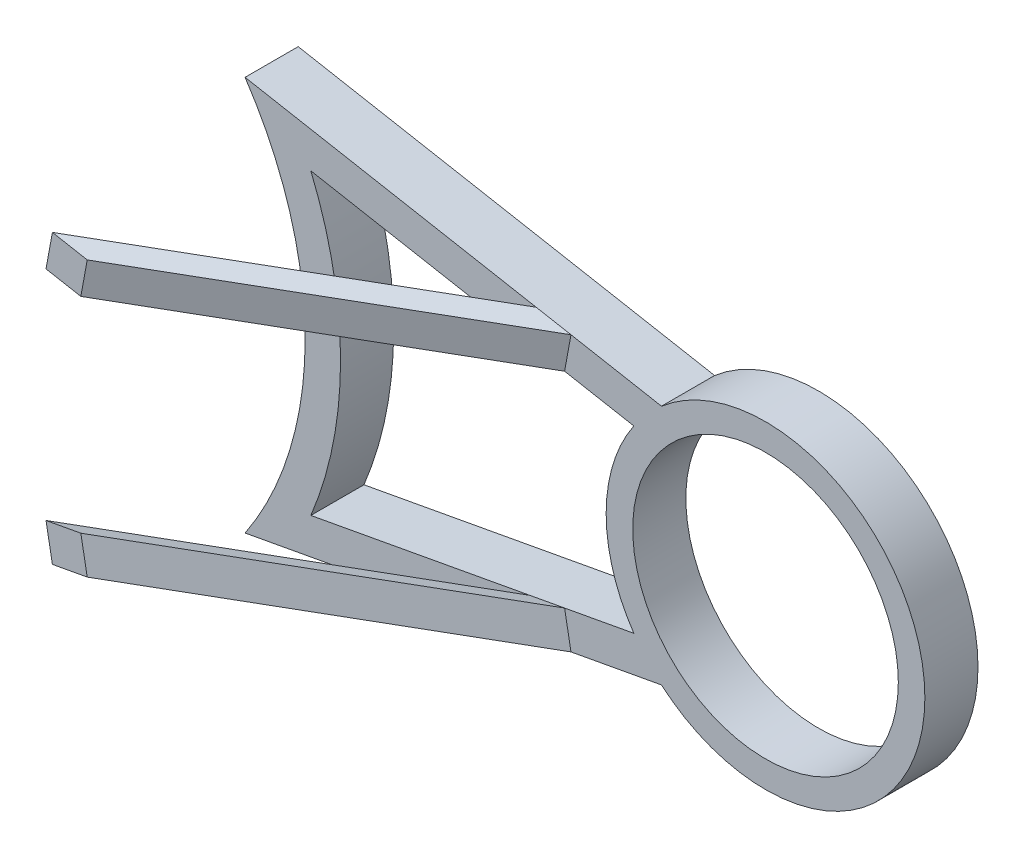
ISO-10303-21;
HEADER;
FILE_DESCRIPTION(('STEP AP214'),'2;1');
FILE_NAME('part.step','',(''),(''),'','','');
FILE_SCHEMA(('AUTOMOTIVE_DESIGN { 1 0 10303 214 1 1 1 1 }'));
ENDSEC;
DATA;
#1=APPLICATION_CONTEXT('core data for automotive mechanical design processes');
#2=APPLICATION_PROTOCOL_DEFINITION('international standard','automotive_design',2000,#1);
#3=PRODUCT_CONTEXT('',#1,'mechanical');
#4=PRODUCT('Part','Part','',(#3));
#5=PRODUCT_RELATED_PRODUCT_CATEGORY('part','',(#4));
#6=PRODUCT_DEFINITION_FORMATION('','',#4);
#7=PRODUCT_DEFINITION_CONTEXT('part definition',#1,'design');
#8=PRODUCT_DEFINITION('design','',#6,#7);
#9=PRODUCT_DEFINITION_SHAPE('','',#8);
#10=(LENGTH_UNIT() NAMED_UNIT(*) SI_UNIT(.MILLI.,.METRE.));
#11=(NAMED_UNIT(*) PLANE_ANGLE_UNIT() SI_UNIT($,.RADIAN.));
#12=(NAMED_UNIT(*) SI_UNIT($,.STERADIAN.) SOLID_ANGLE_UNIT());
#13=UNCERTAINTY_MEASURE_WITH_UNIT(LENGTH_MEASURE(1.E-05),#10,'distance_accuracy_value','');
#14=(GEOMETRIC_REPRESENTATION_CONTEXT(3) GLOBAL_UNCERTAINTY_ASSIGNED_CONTEXT((#13)) GLOBAL_UNIT_ASSIGNED_CONTEXT((#10,
#11,#12)) REPRESENTATION_CONTEXT('',''));
#15=CARTESIAN_POINT('',(0.,0.,0.));
#16=DIRECTION('',(0.,0.,1.));
#17=DIRECTION('',(1.,0.,0.));
#18=AXIS2_PLACEMENT_3D('',#15,#16,#17);
#19=CARTESIAN_POINT('',(4889.77220891143,3641.46133227957,11009.4574157783));
#20=DIRECTION('',(0.,0.,1.));
#21=DIRECTION('',(1.,0.,0.));
#22=AXIS2_PLACEMENT_3D('',#19,#20,#21);
#23=PLANE('',#22);
#24=CARTESIAN_POINT('',(4889.77220891143,3641.46133227957,11009.4574157783));
#25=DIRECTION('',(0.,0.,1.));
#26=DIRECTION('',(1.,0.,0.));
#27=AXIS2_PLACEMENT_3D('',#24,#25,#26);
#28=CIRCLE('',#27,375.);
#29=CARTESIAN_POINT('',(5264.77220891143,3641.46133227957,11009.4574157783));
#30=VERTEX_POINT('',#29);
#31=EDGE_CURVE('E227',#30,#30,#28,.T.);
#32=ORIENTED_EDGE('',*,*,#31,.F.);
#33=EDGE_LOOP('',(#32));
#34=FACE_BOUND('',#33,.T.);
#35=DIRECTION('',(0.983488317783864,0.180971624247187,0.));
#36=VECTOR('',#35,1.);
#37=CARTESIAN_POINT('',(4517.98192605905,3387.94213068618,11009.4574157783));
#38=LINE('',#37,#36);
#39=CARTESIAN_POINT('',(4322.38763499596,3351.95083734074,11009.4574157783));
#40=VERTEX_POINT('',#39);
#41=CARTESIAN_POINT('',(4517.98192605905,3387.94213068618,11009.4574157783));
#42=VERTEX_POINT('',#41);
#43=EDGE_CURVE('E480',#40,#42,#38,.T.);
#44=ORIENTED_EDGE('',*,*,#43,.F.);
#45=DIRECTION('',(-0.180971624247182,0.983488317783865,0.));
#46=VECTOR('',#45,1.);
#47=CARTESIAN_POINT('',(4340.48479742068,3253.60200556236,11009.4574157783));
#48=LINE('',#47,#46);
#49=CARTESIAN_POINT('',(4340.48479742068,3253.60200556236,11009.4574157783));
#50=VERTEX_POINT('',#49);
#51=EDGE_CURVE('E47',#50,#40,#48,.T.);
#52=ORIENTED_EDGE('',*,*,#51,.F.);
#53=DIRECTION('',(0.983488317783864,0.180971624247188,0.));
#54=VECTOR('',#53,1.);
#55=CARTESIAN_POINT('',(4595.96546082499,3300.61298656131,11009.4574157783));
#56=LINE('',#55,#54);
#57=CARTESIAN_POINT('',(4595.96546082499,3300.61298656131,11009.4574157783));
#58=VERTEX_POINT('',#57);
#59=EDGE_CURVE('E271',#50,#58,#56,.T.);
#60=ORIENTED_EDGE('',*,*,#59,.T.);
#61=CARTESIAN_POINT('',(4889.77220891143,3641.46133227957,11009.4574157783));
#62=DIRECTION('',(0.,0.,1.));
#63=DIRECTION('',(1.,0.,0.));
#64=AXIS2_PLACEMENT_3D('',#61,#62,#63);
#65=CIRCLE('',#64,450.);
#66=CARTESIAN_POINT('',(4595.96546082499,3982.30967799782,11009.4574157783));
#67=VERTEX_POINT('',#66);
#68=EDGE_CURVE('E260',#58,#67,#65,.T.);
#69=ORIENTED_EDGE('',*,*,#68,.T.);
#70=DIRECTION('',(-0.983488317783864,0.180971624247188,0.));
#71=VECTOR('',#70,1.);
#72=CARTESIAN_POINT('',(4595.96546082499,3982.30967799782,11009.4574157783));
#73=LINE('',#72,#71);
#74=CARTESIAN_POINT('',(4340.48479742068,4029.32065899677,11009.4574157783));
#75=VERTEX_POINT('',#74);
#76=EDGE_CURVE('E274',#67,#75,#73,.T.);
#77=ORIENTED_EDGE('',*,*,#76,.T.);
#78=DIRECTION('',(0.180971624247184,0.983488317783865,0.));
#79=VECTOR('',#78,1.);
#80=CARTESIAN_POINT('',(4340.48479742068,4029.32065899677,11009.4574157783));
#81=LINE('',#80,#79);
#82=CARTESIAN_POINT('',(4322.38763499596,3930.97182721838,11009.4574157783));
#83=VERTEX_POINT('',#82);
#84=EDGE_CURVE('E167',#83,#75,#81,.T.);
#85=ORIENTED_EDGE('',*,*,#84,.F.);
#86=DIRECTION('',(-0.983488317783864,0.180971624247188,0.));
#87=VECTOR('',#86,1.);
#88=CARTESIAN_POINT('',(4517.98192605905,3894.98053387295,11009.4574157783));
#89=LINE('',#88,#87);
#90=CARTESIAN_POINT('',(4517.98192605905,3894.98053387295,11009.4574157783));
#91=VERTEX_POINT('',#90);
#92=EDGE_CURVE('E246',#91,#83,#89,.T.);
#93=ORIENTED_EDGE('',*,*,#92,.F.);
#94=CARTESIAN_POINT('',(4889.77220891143,3641.46133227957,11009.4574157783));
#95=DIRECTION('',(0.,0.,-1.));
#96=DIRECTION('',(1.,0.,0.));
#97=AXIS2_PLACEMENT_3D('',#94,#95,#96);
#98=CIRCLE('',#97,450.);
#99=EDGE_CURVE('E234',#42,#91,#98,.T.);
#100=ORIENTED_EDGE('',*,*,#99,.F.);
#101=EDGE_LOOP('',(#44,#52,#60,#69,#77,#85,#93,#100));
#102=FACE_BOUND('',#101,.T.);
#103=ADVANCED_FACE('F30',(#34,#102),#23,.T.);
#104=CARTESIAN_POINT('',(3420.14289386198,3084.24994907319,11009.4574157783));
#105=VERTEX_POINT('',#104);
#106=CARTESIAN_POINT('',(4242.1359656423,3235.50484313764,11009.4574157783));
#107=VERTEX_POINT('',#106);
#108=EDGE_CURVE('E257',#105,#107,#56,.T.);
#109=ORIENTED_EDGE('',*,*,#108,.T.);
#110=DIRECTION('',(0.180971624247187,-0.983488317783864,0.));
#111=VECTOR('',#110,1.);
#112=CARTESIAN_POINT('',(4242.1359656423,3235.50484313764,11009.4574157783));
#113=LINE('',#112,#111);
#114=CARTESIAN_POINT('',(4224.03880321758,3333.85367491603,11009.4574157783));
#115=VERTEX_POINT('',#114);
#116=EDGE_CURVE('E477',#115,#107,#113,.T.);
#117=ORIENTED_EDGE('',*,*,#116,.F.);
#118=CARTESIAN_POINT('',(3605.87195783464,3220.10483210639,11009.4574157783));
#119=VERTEX_POINT('',#118);
#120=EDGE_CURVE('E493',#119,#115,#38,.T.);
#121=ORIENTED_EDGE('',*,*,#120,.F.);
#122=CARTESIAN_POINT('',(2589.77220891143,3641.46133227957,11009.4574157783));
#123=DIRECTION('',(0.,0.,-1.));
#124=DIRECTION('',(1.,0.,0.));
#125=AXIS2_PLACEMENT_3D('',#122,#123,#124);
#126=CIRCLE('',#125,1100.);
#127=CARTESIAN_POINT('',(3605.87195783464,4062.81783245274,11009.4574157783));
#128=VERTEX_POINT('',#127);
#129=EDGE_CURVE('E240',#128,#119,#126,.T.);
#130=ORIENTED_EDGE('',*,*,#129,.F.);
#131=CARTESIAN_POINT('',(4224.03880321758,3949.0689896431,11009.4574157783));
#132=VERTEX_POINT('',#131);
#133=EDGE_CURVE('E236',#132,#128,#89,.T.);
#134=ORIENTED_EDGE('',*,*,#133,.F.);
#135=DIRECTION('',(-0.18097162424719,-0.983488317783864,0.));
#136=VECTOR('',#135,1.);
#137=CARTESIAN_POINT('',(4242.1359656423,4047.41782142149,11009.4574157783));
#138=LINE('',#137,#136);
#139=CARTESIAN_POINT('',(4242.1359656423,4047.41782142149,11009.4574157783));
#140=VERTEX_POINT('',#139);
#141=EDGE_CURVE('E55',#140,#132,#138,.T.);
#142=ORIENTED_EDGE('',*,*,#141,.F.);
#143=CARTESIAN_POINT('',(3420.14289386198,4198.67271548594,11009.4574157783));
#144=VERTEX_POINT('',#143);
#145=EDGE_CURVE('E279',#140,#144,#73,.T.);
#146=ORIENTED_EDGE('',*,*,#145,.T.);
#147=CARTESIAN_POINT('',(2589.77220891143,3641.46133227957,11009.4574157783));
#148=DIRECTION('',(0.,0.,-1.));
#149=DIRECTION('',(1.,0.,0.));
#150=AXIS2_PLACEMENT_3D('',#147,#148,#149);
#151=CIRCLE('',#150,1000.);
#152=EDGE_CURVE('E272',#144,#105,#151,.T.);
#153=ORIENTED_EDGE('',*,*,#152,.T.);
#154=EDGE_LOOP('',(#109,#117,#121,#130,#134,#142,#146,#153));
#155=FACE_BOUND('',#154,.T.);
#156=ADVANCED_FACE('F316',(#155),#23,.T.);
#157=CARTESIAN_POINT('',(4889.77220891143,3641.46133227957,10859.4574157783));
#158=DIRECTION('',(0.,0.,1.));
#159=DIRECTION('',(1.,0.,0.));
#160=AXIS2_PLACEMENT_3D('',#157,#158,#159);
#161=PLANE('',#160);
#162=CARTESIAN_POINT('',(4889.77220891143,3641.46133227957,10859.4574157783));
#163=DIRECTION('',(0.,0.,-1.));
#164=DIRECTION('',(1.,0.,0.));
#165=AXIS2_PLACEMENT_3D('',#162,#163,#164);
#166=CIRCLE('',#165,450.);
#167=CARTESIAN_POINT('',(4517.98192605905,3387.94213068618,10859.4574157783));
#168=VERTEX_POINT('',#167);
#169=CARTESIAN_POINT('',(4517.98192605905,3894.98053387295,10859.4574157783));
#170=VERTEX_POINT('',#169);
#171=EDGE_CURVE('E232',#168,#170,#166,.T.);
#172=ORIENTED_EDGE('',*,*,#171,.T.);
#173=DIRECTION('',(-0.983488317783864,0.180971624247188,0.));
#174=VECTOR('',#173,1.);
#175=CARTESIAN_POINT('',(4517.98192605905,3894.98053387295,10859.4574157783));
#176=LINE('',#175,#174);
#177=CARTESIAN_POINT('',(3605.87195783464,4062.81783245274,10859.4574157783));
#178=VERTEX_POINT('',#177);
#179=EDGE_CURVE('E504',#170,#178,#176,.T.);
#180=ORIENTED_EDGE('',*,*,#179,.T.);
#181=CARTESIAN_POINT('',(2589.77220891143,3641.46133227957,10859.4574157783));
#182=DIRECTION('',(0.,0.,-1.));
#183=DIRECTION('',(1.,0.,0.));
#184=AXIS2_PLACEMENT_3D('',#181,#182,#183);
#185=CIRCLE('',#184,1100.);
#186=CARTESIAN_POINT('',(3605.87195783464,3220.10483210639,10859.4574157783));
#187=VERTEX_POINT('',#186);
#188=EDGE_CURVE('E507',#178,#187,#185,.T.);
#189=ORIENTED_EDGE('',*,*,#188,.T.);
#190=DIRECTION('',(0.983488317783864,0.180971624247187,0.));
#191=VECTOR('',#190,1.);
#192=CARTESIAN_POINT('',(4517.98192605905,3387.94213068618,10859.4574157783));
#193=LINE('',#192,#191);
#194=EDGE_CURVE('E237',#187,#168,#193,.T.);
#195=ORIENTED_EDGE('',*,*,#194,.T.);
#196=EDGE_LOOP('',(#172,#180,#189,#195));
#197=FACE_BOUND('',#196,.T.);
#198=CARTESIAN_POINT('',(4889.77220891143,3641.46133227957,10859.4574157783));
#199=DIRECTION('',(0.,0.,1.));
#200=DIRECTION('',(1.,0.,0.));
#201=AXIS2_PLACEMENT_3D('',#198,#199,#200);
#202=CIRCLE('',#201,450.);
#203=CARTESIAN_POINT('',(4595.96546082499,3300.61298656131,10859.4574157783));
#204=VERTEX_POINT('',#203);
#205=CARTESIAN_POINT('',(4595.96546082499,3982.30967799782,10859.4574157783));
#206=VERTEX_POINT('',#205);
#207=EDGE_CURVE('E265',#204,#206,#202,.T.);
#208=ORIENTED_EDGE('',*,*,#207,.F.);
#209=DIRECTION('',(0.983488317783864,0.180971624247188,0.));
#210=VECTOR('',#209,1.);
#211=CARTESIAN_POINT('',(4595.96546082499,3300.61298656131,10859.4574157783));
#212=LINE('',#211,#210);
#213=CARTESIAN_POINT('',(3420.14289386198,3084.24994907319,10859.4574157783));
#214=VERTEX_POINT('',#213);
#215=EDGE_CURVE('E258',#214,#204,#212,.T.);
#216=ORIENTED_EDGE('',*,*,#215,.F.);
#217=CARTESIAN_POINT('',(2589.77220891143,3641.46133227957,10859.4574157783));
#218=DIRECTION('',(0.,0.,-1.));
#219=DIRECTION('',(1.,0.,0.));
#220=AXIS2_PLACEMENT_3D('',#217,#218,#219);
#221=CIRCLE('',#220,1000.);
#222=CARTESIAN_POINT('',(3420.14289386198,4198.67271548594,10859.4574157783));
#223=VERTEX_POINT('',#222);
#224=EDGE_CURVE('E261',#223,#214,#221,.T.);
#225=ORIENTED_EDGE('',*,*,#224,.F.);
#226=DIRECTION('',(-0.983488317783864,0.180971624247188,0.));
#227=VECTOR('',#226,1.);
#228=CARTESIAN_POINT('',(4595.96546082499,3982.30967799782,10859.4574157783));
#229=LINE('',#228,#227);
#230=EDGE_CURVE('E263',#206,#223,#229,.T.);
#231=ORIENTED_EDGE('',*,*,#230,.F.);
#232=EDGE_LOOP('',(#208,#216,#225,#231));
#233=FACE_BOUND('',#232,.T.);
#234=CARTESIAN_POINT('',(4889.77220891143,3641.46133227957,10859.4574157783));
#235=DIRECTION('',(0.,0.,1.));
#236=DIRECTION('',(1.,0.,0.));
#237=AXIS2_PLACEMENT_3D('',#234,#235,#236);
#238=CIRCLE('',#237,375.);
#239=CARTESIAN_POINT('',(5264.77220891143,3641.46133227957,10859.4574157783));
#240=VERTEX_POINT('',#239);
#241=EDGE_CURVE('E223',#240,#240,#238,.T.);
#242=ORIENTED_EDGE('',*,*,#241,.T.);
#243=EDGE_LOOP('',(#242));
#244=FACE_BOUND('',#243,.T.);
#245=ADVANCED_FACE('F322',(#197,#233,#244),#161,.F.);
#246=CARTESIAN_POINT('',(4889.77220891143,3641.46133227957,11009.4574157783));
#247=DIRECTION('',(0.,0.,-1.));
#248=DIRECTION('',(-1.,0.,0.));
#249=AXIS2_PLACEMENT_3D('',#246,#247,#248);
#250=CYLINDRICAL_SURFACE('',#249,450.);
#251=ORIENTED_EDGE('',*,*,#207,.T.);
#252=DIRECTION('',(0.,0.,-1.));
#253=VECTOR('',#252,1.);
#254=CARTESIAN_POINT('',(4595.96546082499,3982.30967799782,11009.4574157783));
#255=LINE('',#254,#253);
#256=EDGE_CURVE('E11',#67,#206,#255,.T.);
#257=ORIENTED_EDGE('',*,*,#256,.F.);
#258=ORIENTED_EDGE('',*,*,#68,.F.);
#259=DIRECTION('',(0.,0.,-1.));
#260=VECTOR('',#259,1.);
#261=CARTESIAN_POINT('',(4595.96546082499,3300.61298656131,11009.4574157783));
#262=LINE('',#261,#260);
#263=EDGE_CURVE('E254',#58,#204,#262,.T.);
#264=ORIENTED_EDGE('',*,*,#263,.T.);
#265=EDGE_LOOP('',(#251,#257,#258,#264));
#266=FACE_BOUND('',#265,.T.);
#267=ADVANCED_FACE('F32',(#266),#250,.T.);
#268=CARTESIAN_POINT('',(4595.96546082499,3982.30967799782,11009.4574157783));
#269=DIRECTION('',(-0.180971624247188,-0.983488317783864,0.));
#270=DIRECTION('',(0.983488317783864,-0.180971624247188,0.));
#271=AXIS2_PLACEMENT_3D('',#268,#269,#270);
#272=PLANE('',#271);
#273=ORIENTED_EDGE('',*,*,#230,.T.);
#274=DIRECTION('',(0.,0.,-1.));
#275=VECTOR('',#274,1.);
#276=CARTESIAN_POINT('',(3420.14289386198,4198.67271548594,11009.4574157783));
#277=LINE('',#276,#275);
#278=EDGE_CURVE('E39',#144,#223,#277,.T.);
#279=ORIENTED_EDGE('',*,*,#278,.F.);
#280=ORIENTED_EDGE('',*,*,#145,.F.);
#281=DIRECTION('',(-0.983488317783862,0.180971624247199,0.));
#282=VECTOR('',#281,1.);
#283=CARTESIAN_POINT('',(4340.48479742068,4029.32065899677,11009.4574157783));
#284=LINE('',#283,#282);
#285=EDGE_CURVE('E170',#75,#140,#284,.T.);
#286=ORIENTED_EDGE('',*,*,#285,.F.);
#287=ORIENTED_EDGE('',*,*,#76,.F.);
#288=ORIENTED_EDGE('',*,*,#256,.T.);
#289=EDGE_LOOP('',(#273,#279,#280,#286,#287,#288));
#290=FACE_BOUND('',#289,.T.);
#291=ADVANCED_FACE('F291',(#290),#272,.F.);
#292=CARTESIAN_POINT('',(2589.77220891143,3641.46133227957,11009.4574157783));
#293=DIRECTION('',(0.,0.,-1.));
#294=DIRECTION('',(-1.,0.,0.));
#295=AXIS2_PLACEMENT_3D('',#292,#293,#294);
#296=CYLINDRICAL_SURFACE('',#295,1000.);
#297=ORIENTED_EDGE('',*,*,#224,.T.);
#298=DIRECTION('',(0.,0.,-1.));
#299=VECTOR('',#298,1.);
#300=CARTESIAN_POINT('',(3420.14289386198,3084.24994907319,11009.4574157783));
#301=LINE('',#300,#299);
#302=EDGE_CURVE('E251',#105,#214,#301,.T.);
#303=ORIENTED_EDGE('',*,*,#302,.F.);
#304=ORIENTED_EDGE('',*,*,#152,.F.);
#305=ORIENTED_EDGE('',*,*,#278,.T.);
#306=EDGE_LOOP('',(#297,#303,#304,#305));
#307=FACE_BOUND('',#306,.T.);
#308=ADVANCED_FACE('F334',(#307),#296,.F.);
#309=CARTESIAN_POINT('',(4595.96546082499,3300.61298656131,11009.4574157783));
#310=DIRECTION('',(-0.180971624247188,0.983488317783864,0.));
#311=DIRECTION('',(-0.983488317783864,-0.180971624247188,0.));
#312=AXIS2_PLACEMENT_3D('',#309,#310,#311);
#313=PLANE('',#312);
#314=ORIENTED_EDGE('',*,*,#215,.T.);
#315=ORIENTED_EDGE('',*,*,#263,.F.);
#316=ORIENTED_EDGE('',*,*,#59,.F.);
#317=DIRECTION('',(0.983488317783862,0.180971624247199,0.));
#318=VECTOR('',#317,1.);
#319=CARTESIAN_POINT('',(4340.48479742068,3253.60200556236,11009.4574157783));
#320=LINE('',#319,#318);
#321=EDGE_CURVE('E164',#107,#50,#320,.T.);
#322=ORIENTED_EDGE('',*,*,#321,.F.);
#323=ORIENTED_EDGE('',*,*,#108,.F.);
#324=ORIENTED_EDGE('',*,*,#302,.T.);
#325=EDGE_LOOP('',(#314,#315,#316,#322,#323,#324));
#326=FACE_BOUND('',#325,.T.);
#327=ADVANCED_FACE('F331',(#326),#313,.F.);
#328=CARTESIAN_POINT('',(4889.77220891143,3641.46133227957,11009.4574157783));
#329=DIRECTION('',(0.,0.,-1.));
#330=DIRECTION('',(-1.,0.,0.));
#331=AXIS2_PLACEMENT_3D('',#328,#329,#330);
#332=CYLINDRICAL_SURFACE('',#331,450.);
#333=ORIENTED_EDGE('',*,*,#171,.F.);
#334=DIRECTION('',(0.,0.,-1.));
#335=VECTOR('',#334,1.);
#336=CARTESIAN_POINT('',(4517.98192605905,3387.94213068618,11009.4574157783));
#337=LINE('',#336,#335);
#338=EDGE_CURVE('E498',#42,#168,#337,.T.);
#339=ORIENTED_EDGE('',*,*,#338,.F.);
#340=ORIENTED_EDGE('',*,*,#99,.T.);
#341=DIRECTION('',(0.,0.,-1.));
#342=VECTOR('',#341,1.);
#343=CARTESIAN_POINT('',(4517.98192605905,3894.98053387295,11009.4574157783));
#344=LINE('',#343,#342);
#345=EDGE_CURVE('E268',#91,#170,#344,.T.);
#346=ORIENTED_EDGE('',*,*,#345,.T.);
#347=EDGE_LOOP('',(#333,#339,#340,#346));
#348=FACE_BOUND('',#347,.T.);
#349=ADVANCED_FACE('F326',(#348),#332,.T.);
#350=CARTESIAN_POINT('',(4517.98192605905,3894.98053387295,11009.4574157783));
#351=DIRECTION('',(-0.180971624247188,-0.983488317783864,0.));
#352=DIRECTION('',(0.983488317783864,-0.180971624247188,0.));
#353=AXIS2_PLACEMENT_3D('',#350,#351,#352);
#354=PLANE('',#353);
#355=ORIENTED_EDGE('',*,*,#179,.F.);
#356=ORIENTED_EDGE('',*,*,#345,.F.);
#357=ORIENTED_EDGE('',*,*,#92,.T.);
#358=DIRECTION('',(0.983488317783865,-0.180971624247185,0.));
#359=VECTOR('',#358,1.);
#360=CARTESIAN_POINT('',(4322.38763499596,3930.97182721838,11009.4574157783));
#361=LINE('',#360,#359);
#362=EDGE_CURVE('E180',#132,#83,#361,.T.);
#363=ORIENTED_EDGE('',*,*,#362,.F.);
#364=ORIENTED_EDGE('',*,*,#133,.T.);
#365=DIRECTION('',(0.,0.,-1.));
#366=VECTOR('',#365,1.);
#367=CARTESIAN_POINT('',(3605.87195783464,4062.81783245274,11009.4574157783));
#368=LINE('',#367,#366);
#369=EDGE_CURVE('E513',#128,#178,#368,.T.);
#370=ORIENTED_EDGE('',*,*,#369,.T.);
#371=EDGE_LOOP('',(#355,#356,#357,#363,#364,#370));
#372=FACE_BOUND('',#371,.T.);
#373=ADVANCED_FACE('F304',(#372),#354,.T.);
#374=CARTESIAN_POINT('',(2589.77220891143,3641.46133227957,11009.4574157783));
#375=DIRECTION('',(0.,0.,-1.));
#376=DIRECTION('',(-1.,0.,0.));
#377=AXIS2_PLACEMENT_3D('',#374,#375,#376);
#378=CYLINDRICAL_SURFACE('',#377,1100.);
#379=ORIENTED_EDGE('',*,*,#188,.F.);
#380=ORIENTED_EDGE('',*,*,#369,.F.);
#381=ORIENTED_EDGE('',*,*,#129,.T.);
#382=DIRECTION('',(0.,0.,-1.));
#383=VECTOR('',#382,1.);
#384=CARTESIAN_POINT('',(3605.87195783464,3220.10483210639,11009.4574157783));
#385=LINE('',#384,#383);
#386=EDGE_CURVE('E496',#119,#187,#385,.T.);
#387=ORIENTED_EDGE('',*,*,#386,.T.);
#388=EDGE_LOOP('',(#379,#380,#381,#387));
#389=FACE_BOUND('',#388,.T.);
#390=ADVANCED_FACE('F379',(#389),#378,.T.);
#391=CARTESIAN_POINT('',(4517.98192605905,3387.94213068618,11009.4574157783));
#392=DIRECTION('',(-0.180971624247187,0.983488317783864,0.));
#393=DIRECTION('',(-0.983488317783864,-0.180971624247187,0.));
#394=AXIS2_PLACEMENT_3D('',#391,#392,#393);
#395=PLANE('',#394);
#396=ORIENTED_EDGE('',*,*,#194,.F.);
#397=ORIENTED_EDGE('',*,*,#386,.F.);
#398=ORIENTED_EDGE('',*,*,#120,.T.);
#399=DIRECTION('',(-0.983488317783865,-0.18097162424718,0.));
#400=VECTOR('',#399,1.);
#401=CARTESIAN_POINT('',(4322.38763499597,3351.95083734074,11009.4574157783));
#402=LINE('',#401,#400);
#403=EDGE_CURVE('E482',#40,#115,#402,.T.);
#404=ORIENTED_EDGE('',*,*,#403,.F.);
#405=ORIENTED_EDGE('',*,*,#43,.T.);
#406=ORIENTED_EDGE('',*,*,#338,.T.);
#407=EDGE_LOOP('',(#396,#397,#398,#404,#405,#406));
#408=FACE_BOUND('',#407,.T.);
#409=ADVANCED_FACE('F385',(#408),#395,.T.);
#410=CARTESIAN_POINT('',(4889.77220891143,3641.46133227957,11009.4574157783));
#411=DIRECTION('',(0.,0.,-1.));
#412=DIRECTION('',(-1.,0.,0.));
#413=AXIS2_PLACEMENT_3D('',#410,#411,#412);
#414=CYLINDRICAL_SURFACE('',#413,375.);
#415=ORIENTED_EDGE('',*,*,#31,.T.);
#416=EDGE_LOOP('',(#415));
#417=FACE_BOUND('',#416,.T.);
#418=ORIENTED_EDGE('',*,*,#241,.F.);
#419=EDGE_LOOP('',(#418));
#420=FACE_BOUND('',#419,.T.);
#421=ADVANCED_FACE('F390',(#417,#420),#414,.F.);
#422=CARTESIAN_POINT('',(3474.45939363624,4029.32065899677,11509.4574157783));
#423=DIRECTION('',(-0.497897112616072,0.0916180167560621,-0.862383095992879));
#424=DIRECTION('',(-0.866025403784438,0.,0.5));
#425=AXIS2_PLACEMENT_3D('',#422,#423,#424);
#426=PLANE('',#425);
#427=ORIENTED_EDGE('',*,*,#84,.T.);
#428=DIRECTION('',(0.866025403784438,0.,-0.5));
#429=VECTOR('',#428,1.);
#430=CARTESIAN_POINT('',(3474.45939363624,4029.32065899677,11509.4574157783));
#431=LINE('',#430,#429);
#432=CARTESIAN_POINT('',(3474.45939363624,4029.32065899677,11509.4574157783));
#433=VERTEX_POINT('',#432);
#434=EDGE_CURVE('E207',#433,#75,#431,.T.);
#435=ORIENTED_EDGE('',*,*,#434,.F.);
#436=DIRECTION('',(0.180971624247184,0.983488317783865,0.));
#437=VECTOR('',#436,1.);
#438=CARTESIAN_POINT('',(3474.45939363624,4029.32065899677,11509.4574157783));
#439=LINE('',#438,#437);
#440=CARTESIAN_POINT('',(3456.36223121153,3930.97182721838,11509.4574157783));
#441=VERTEX_POINT('',#440);
#442=EDGE_CURVE('E176',#441,#433,#439,.T.);
#443=ORIENTED_EDGE('',*,*,#442,.F.);
#444=DIRECTION('',(0.866025403784438,0.,-0.5));
#445=VECTOR('',#444,1.);
#446=CARTESIAN_POINT('',(3456.36223121153,3930.97182721838,11509.4574157783));
#447=LINE('',#446,#445);
#448=EDGE_CURVE('E186',#441,#83,#447,.T.);
#449=ORIENTED_EDGE('',*,*,#448,.T.);
#450=EDGE_LOOP('',(#427,#435,#443,#449));
#451=FACE_BOUND('',#450,.T.);
#452=ADVANCED_FACE('F299',(#451),#426,.F.);
#453=CARTESIAN_POINT('',(3474.45939363624,4029.32065899677,11509.4574157783));
#454=DIRECTION('',(-0.172686920956168,-0.938465188125118,-0.299102520898713));
#455=DIRECTION('',(0.,0.303664544755699,-0.952779011239393));
#456=AXIS2_PLACEMENT_3D('',#453,#454,#455);
#457=PLANE('',#456);
#458=ORIENTED_EDGE('',*,*,#285,.T.);
#459=DIRECTION('',(0.866025403784438,0.,-0.5));
#460=VECTOR('',#459,1.);
#461=CARTESIAN_POINT('',(3376.11056185786,4047.41782142149,11509.4574157783));
#462=LINE('',#461,#460);
#463=CARTESIAN_POINT('',(3376.11056185786,4047.41782142149,11509.4574157783));
#464=VERTEX_POINT('',#463);
#465=EDGE_CURVE('E200',#464,#140,#462,.T.);
#466=ORIENTED_EDGE('',*,*,#465,.F.);
#467=DIRECTION('',(-0.983488317783862,0.180971624247199,0.));
#468=VECTOR('',#467,1.);
#469=CARTESIAN_POINT('',(3474.45939363624,4029.32065899677,11509.4574157783));
#470=LINE('',#469,#468);
#471=EDGE_CURVE('E179',#433,#464,#470,.T.);
#472=ORIENTED_EDGE('',*,*,#471,.F.);
#473=ORIENTED_EDGE('',*,*,#434,.T.);
#474=EDGE_LOOP('',(#458,#466,#472,#473));
#475=FACE_BOUND('',#474,.T.);
#476=ADVANCED_FACE('F293',(#475),#457,.F.);
#477=CARTESIAN_POINT('',(3376.11056185786,4047.41782142149,11509.4574157783));
#478=DIRECTION('',(0.497897112616072,-0.0916180167560653,0.862383095992879));
#479=DIRECTION('',(0.866025403784438,0.,-0.5));
#480=AXIS2_PLACEMENT_3D('',#477,#478,#479);
#481=PLANE('',#480);
#482=ORIENTED_EDGE('',*,*,#141,.T.);
#483=DIRECTION('',(0.866025403784438,0.,-0.5));
#484=VECTOR('',#483,1.);
#485=CARTESIAN_POINT('',(3358.01339943314,3949.0689896431,11509.4574157783));
#486=LINE('',#485,#484);
#487=CARTESIAN_POINT('',(3358.01339943314,3949.0689896431,11509.4574157783));
#488=VERTEX_POINT('',#487);
#489=EDGE_CURVE('E195',#488,#132,#486,.T.);
#490=ORIENTED_EDGE('',*,*,#489,.F.);
#491=DIRECTION('',(-0.18097162424719,-0.983488317783864,0.));
#492=VECTOR('',#491,1.);
#493=CARTESIAN_POINT('',(3376.11056185786,4047.41782142149,11509.4574157783));
#494=LINE('',#493,#492);
#495=EDGE_CURVE('E182',#464,#488,#494,.T.);
#496=ORIENTED_EDGE('',*,*,#495,.F.);
#497=ORIENTED_EDGE('',*,*,#465,.T.);
#498=EDGE_LOOP('',(#482,#490,#496,#497));
#499=FACE_BOUND('',#498,.T.);
#500=ADVANCED_FACE('F296',(#499),#481,.F.);
#501=CARTESIAN_POINT('',(3456.36223121153,3930.97182721838,11509.4574157783));
#502=DIRECTION('',(0.172686920956155,0.938465188125127,0.299102520898691));
#503=DIRECTION('',(0.,-0.303664544755676,0.9527790112394));
#504=AXIS2_PLACEMENT_3D('',#501,#502,#503);
#505=PLANE('',#504);
#506=ORIENTED_EDGE('',*,*,#362,.T.);
#507=ORIENTED_EDGE('',*,*,#448,.F.);
#508=DIRECTION('',(0.983488317783865,-0.180971624247185,0.));
#509=VECTOR('',#508,1.);
#510=CARTESIAN_POINT('',(3456.36223121153,3930.97182721838,11509.4574157783));
#511=LINE('',#510,#509);
#512=EDGE_CURVE('E184',#488,#441,#511,.T.);
#513=ORIENTED_EDGE('',*,*,#512,.F.);
#514=ORIENTED_EDGE('',*,*,#489,.T.);
#515=EDGE_LOOP('',(#506,#507,#513,#514));
#516=FACE_BOUND('',#515,.T.);
#517=ADVANCED_FACE('F306',(#516),#505,.F.);
#518=CARTESIAN_POINT('',(3456.36223121153,3930.97182721838,11509.4574157783));
#519=DIRECTION('',(0.,0.,-1.));
#520=DIRECTION('',(-1.,0.,0.));
#521=AXIS2_PLACEMENT_3D('',#518,#519,#520);
#522=PLANE('',#521);
#523=ORIENTED_EDGE('',*,*,#442,.T.);
#524=ORIENTED_EDGE('',*,*,#471,.T.);
#525=ORIENTED_EDGE('',*,*,#495,.T.);
#526=ORIENTED_EDGE('',*,*,#512,.T.);
#527=EDGE_LOOP('',(#523,#524,#525,#526));
#528=FACE_BOUND('',#527,.T.);
#529=ADVANCED_FACE('F298',(#528),#522,.F.);
#530=CARTESIAN_POINT('',(3474.45939363625,3253.60200556236,11509.4574157783));
#531=DIRECTION('',(-0.497897112616072,-0.0916180167560613,-0.86238309599288));
#532=DIRECTION('',(-0.866025403784438,0.,0.5));
#533=AXIS2_PLACEMENT_3D('',#530,#531,#532);
#534=PLANE('',#533);
#535=ORIENTED_EDGE('',*,*,#51,.T.);
#536=DIRECTION('',(0.866025403784438,0.,-0.5));
#537=VECTOR('',#536,1.);
#538=CARTESIAN_POINT('',(3456.36223121153,3351.95083734074,11509.4574157783));
#539=LINE('',#538,#537);
#540=CARTESIAN_POINT('',(3456.36223121153,3351.95083734074,11509.4574157783));
#541=VERTEX_POINT('',#540);
#542=EDGE_CURVE('E150',#541,#40,#539,.T.);
#543=ORIENTED_EDGE('',*,*,#542,.F.);
#544=DIRECTION('',(-0.180971624247182,0.983488317783865,0.));
#545=VECTOR('',#544,1.);
#546=CARTESIAN_POINT('',(3474.45939363625,3253.60200556236,11509.4574157783));
#547=LINE('',#546,#545);
#548=CARTESIAN_POINT('',(3474.45939363625,3253.60200556236,11509.4574157783));
#549=VERTEX_POINT('',#548);
#550=EDGE_CURVE('E157',#549,#541,#547,.T.);
#551=ORIENTED_EDGE('',*,*,#550,.F.);
#552=DIRECTION('',(0.866025403784438,0.,-0.5));
#553=VECTOR('',#552,1.);
#554=CARTESIAN_POINT('',(3474.45939363625,3253.60200556236,11509.4574157783));
#555=LINE('',#554,#553);
#556=EDGE_CURVE('E474',#549,#50,#555,.T.);
#557=ORIENTED_EDGE('',*,*,#556,.T.);
#558=EDGE_LOOP('',(#535,#543,#551,#557));
#559=FACE_BOUND('',#558,.T.);
#560=ADVANCED_FACE('F166',(#559),#534,.F.);
#561=CARTESIAN_POINT('',(3456.36223121153,3351.95083734074,11509.4574157783));
#562=DIRECTION('',(0.172686920956151,-0.93846518812513,0.299102520898684));
#563=DIRECTION('',(0.,-0.303664544755669,-0.952779011239402));
#564=AXIS2_PLACEMENT_3D('',#561,#562,#563);
#565=PLANE('',#564);
#566=ORIENTED_EDGE('',*,*,#403,.T.);
#567=DIRECTION('',(0.866025403784438,0.,-0.5));
#568=VECTOR('',#567,1.);
#569=CARTESIAN_POINT('',(3358.01339943314,3333.85367491603,11509.4574157783));
#570=LINE('',#569,#568);
#571=CARTESIAN_POINT('',(3358.01339943314,3333.85367491603,11509.4574157783));
#572=VERTEX_POINT('',#571);
#573=EDGE_CURVE('E153',#572,#115,#570,.T.);
#574=ORIENTED_EDGE('',*,*,#573,.F.);
#575=DIRECTION('',(-0.983488317783865,-0.18097162424718,0.));
#576=VECTOR('',#575,1.);
#577=CARTESIAN_POINT('',(3456.36223121153,3351.95083734074,11509.4574157783));
#578=LINE('',#577,#576);
#579=EDGE_CURVE('E147',#541,#572,#578,.T.);
#580=ORIENTED_EDGE('',*,*,#579,.F.);
#581=ORIENTED_EDGE('',*,*,#542,.T.);
#582=EDGE_LOOP('',(#566,#574,#580,#581));
#583=FACE_BOUND('',#582,.T.);
#584=ADVANCED_FACE('F149',(#583),#565,.F.);
#585=CARTESIAN_POINT('',(3376.11056185786,3235.50484313764,11509.4574157783));
#586=DIRECTION('',(0.497897112616072,0.0916180167560641,0.862383095992879));
#587=DIRECTION('',(0.866025403784438,0.,-0.5));
#588=AXIS2_PLACEMENT_3D('',#585,#586,#587);
#589=PLANE('',#588);
#590=ORIENTED_EDGE('',*,*,#116,.T.);
#591=DIRECTION('',(0.866025403784438,0.,-0.5));
#592=VECTOR('',#591,1.);
#593=CARTESIAN_POINT('',(3376.11056185786,3235.50484313764,11509.4574157783));
#594=LINE('',#593,#592);
#595=CARTESIAN_POINT('',(3376.11056185786,3235.50484313764,11509.4574157783));
#596=VERTEX_POINT('',#595);
#597=EDGE_CURVE('E172',#596,#107,#594,.T.);
#598=ORIENTED_EDGE('',*,*,#597,.F.);
#599=DIRECTION('',(0.180971624247187,-0.983488317783864,0.));
#600=VECTOR('',#599,1.);
#601=CARTESIAN_POINT('',(3376.11056185786,3235.50484313764,11509.4574157783));
#602=LINE('',#601,#600);
#603=EDGE_CURVE('E156',#572,#596,#602,.T.);
#604=ORIENTED_EDGE('',*,*,#603,.F.);
#605=ORIENTED_EDGE('',*,*,#573,.T.);
#606=EDGE_LOOP('',(#590,#598,#604,#605));
#607=FACE_BOUND('',#606,.T.);
#608=ADVANCED_FACE('F441',(#607),#589,.F.);
#609=CARTESIAN_POINT('',(3474.45939363625,3253.60200556236,11509.4574157783));
#610=DIRECTION('',(-0.172686920956168,0.938465188125118,-0.299102520898713));
#611=DIRECTION('',(0.,0.303664544755699,0.952779011239393));
#612=AXIS2_PLACEMENT_3D('',#609,#610,#611);
#613=PLANE('',#612);
#614=ORIENTED_EDGE('',*,*,#321,.T.);
#615=ORIENTED_EDGE('',*,*,#556,.F.);
#616=DIRECTION('',(0.983488317783862,0.180971624247199,0.));
#617=VECTOR('',#616,1.);
#618=CARTESIAN_POINT('',(3474.45939363625,3253.60200556236,11509.4574157783));
#619=LINE('',#618,#617);
#620=EDGE_CURVE('E162',#596,#549,#619,.T.);
#621=ORIENTED_EDGE('',*,*,#620,.F.);
#622=ORIENTED_EDGE('',*,*,#597,.T.);
#623=EDGE_LOOP('',(#614,#615,#621,#622));
#624=FACE_BOUND('',#623,.T.);
#625=ADVANCED_FACE('F450',(#624),#613,.F.);
#626=CARTESIAN_POINT('',(3456.36223121153,3351.95083734074,11509.4574157783));
#627=DIRECTION('',(0.,0.,1.));
#628=DIRECTION('',(1.,0.,0.));
#629=AXIS2_PLACEMENT_3D('',#626,#627,#628);
#630=PLANE('',#629);
#631=ORIENTED_EDGE('',*,*,#550,.T.);
#632=ORIENTED_EDGE('',*,*,#579,.T.);
#633=ORIENTED_EDGE('',*,*,#603,.T.);
#634=ORIENTED_EDGE('',*,*,#620,.T.);
#635=EDGE_LOOP('',(#631,#632,#633,#634));
#636=FACE_BOUND('',#635,.T.);
#637=ADVANCED_FACE('F160',(#636),#630,.T.);
#638=CLOSED_SHELL('',(#103,#156,#245,#267,#291,#308,#327,#349,#373,#390,#409,#421,#452,#476,
#500,#517,#529,#560,#584,#608,#625,#637));
#639=MANIFOLD_SOLID_BREP('B2',#638);
#640=ADVANCED_BREP_SHAPE_REPRESENTATION('',(#18,#639),#14);
#641=SHAPE_DEFINITION_REPRESENTATION(#9,#640);
ENDSEC;
END-ISO-10303-21;
